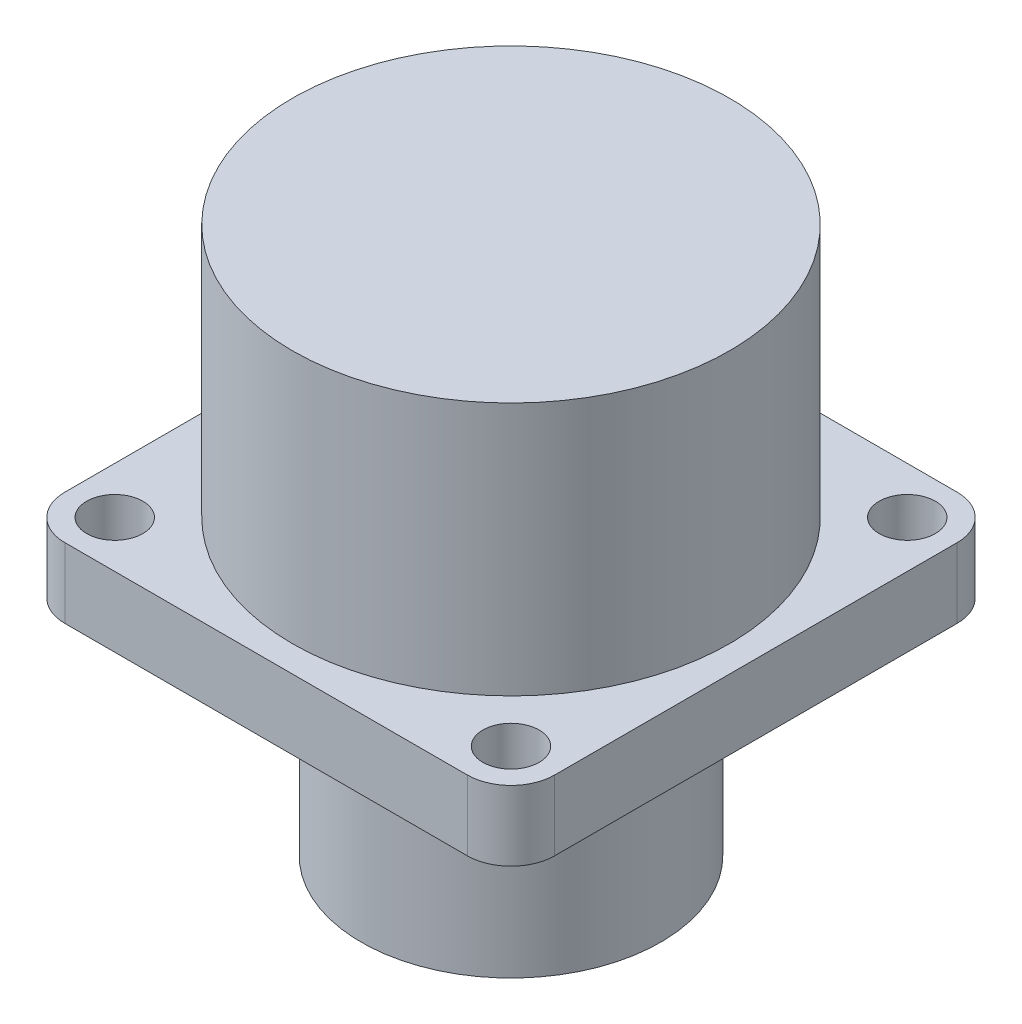
ISO-10303-21;
HEADER;
FILE_DESCRIPTION(('STEP AP214'),'2;1');
FILE_NAME('part.step','',(''),(''),'','','');
FILE_SCHEMA(('AUTOMOTIVE_DESIGN { 1 0 10303 214 1 1 1 1 }'));
ENDSEC;
DATA;
#1=APPLICATION_CONTEXT('core data for automotive mechanical design processes');
#2=APPLICATION_PROTOCOL_DEFINITION('international standard','automotive_design',2000,#1);
#3=PRODUCT_CONTEXT('',#1,'mechanical');
#4=PRODUCT('Part','Part','',(#3));
#5=PRODUCT_RELATED_PRODUCT_CATEGORY('part','',(#4));
#6=PRODUCT_DEFINITION_FORMATION('','',#4);
#7=PRODUCT_DEFINITION_CONTEXT('part definition',#1,'design');
#8=PRODUCT_DEFINITION('design','',#6,#7);
#9=PRODUCT_DEFINITION_SHAPE('','',#8);
#10=(LENGTH_UNIT() NAMED_UNIT(*) SI_UNIT(.MILLI.,.METRE.));
#11=(NAMED_UNIT(*) PLANE_ANGLE_UNIT() SI_UNIT($,.RADIAN.));
#12=(NAMED_UNIT(*) SI_UNIT($,.STERADIAN.) SOLID_ANGLE_UNIT());
#13=UNCERTAINTY_MEASURE_WITH_UNIT(LENGTH_MEASURE(1.E-05),#10,'distance_accuracy_value','');
#14=(GEOMETRIC_REPRESENTATION_CONTEXT(3) GLOBAL_UNCERTAINTY_ASSIGNED_CONTEXT((#13)) GLOBAL_UNIT_ASSIGNED_CONTEXT((#10,
#11,#12)) REPRESENTATION_CONTEXT('',''));
#15=CARTESIAN_POINT('',(0.,0.,0.));
#16=DIRECTION('',(0.,0.,1.));
#17=DIRECTION('',(1.,0.,0.));
#18=AXIS2_PLACEMENT_3D('',#15,#16,#17);
#19=CARTESIAN_POINT('',(14.224,4.064,14.224));
#20=DIRECTION('',(-1.,0.,0.));
#21=DIRECTION('',(0.,0.,1.));
#22=AXIS2_PLACEMENT_3D('',#19,#20,#21);
#23=PLANE('',#22);
#24=DIRECTION('',(0.,0.,-1.));
#25=VECTOR('',#24,1.);
#26=CARTESIAN_POINT('',(14.224,4.064,14.224));
#27=LINE('',#26,#25);
#28=CARTESIAN_POINT('',(14.224,4.064,11.684));
#29=VERTEX_POINT('',#28);
#30=CARTESIAN_POINT('',(14.224,4.064,-11.684));
#31=VERTEX_POINT('',#30);
#32=EDGE_CURVE('E117',#29,#31,#27,.T.);
#33=ORIENTED_EDGE('',*,*,#32,.F.);
#34=DIRECTION('',(0.,-1.,0.));
#35=VECTOR('',#34,1.);
#36=CARTESIAN_POINT('',(14.224,4.064,11.684));
#37=LINE('',#36,#35);
#38=CARTESIAN_POINT('',(14.224,0.,11.684));
#39=VERTEX_POINT('',#38);
#40=EDGE_CURVE('E102',#29,#39,#37,.T.);
#41=ORIENTED_EDGE('',*,*,#40,.T.);
#42=DIRECTION('',(0.,0.,-1.));
#43=VECTOR('',#42,1.);
#44=CARTESIAN_POINT('',(14.224,0.,14.224));
#45=LINE('',#44,#43);
#46=CARTESIAN_POINT('',(14.224,0.,-11.684));
#47=VERTEX_POINT('',#46);
#48=EDGE_CURVE('E114',#39,#47,#45,.T.);
#49=ORIENTED_EDGE('',*,*,#48,.T.);
#50=DIRECTION('',(0.,-1.,0.));
#51=VECTOR('',#50,1.);
#52=CARTESIAN_POINT('',(14.224,4.064,-11.684));
#53=LINE('',#52,#51);
#54=EDGE_CURVE('E119',#47,#31,#53,.F.);
#55=ORIENTED_EDGE('',*,*,#54,.T.);
#56=EDGE_LOOP('',(#33,#41,#49,#55));
#57=FACE_BOUND('',#56,.T.);
#58=ADVANCED_FACE('F33',(#57),#23,.F.);
#59=CARTESIAN_POINT('',(-14.224,4.064,-14.224));
#60=DIRECTION('',(0.,0.,1.));
#61=DIRECTION('',(1.,0.,0.));
#62=AXIS2_PLACEMENT_3D('',#59,#60,#61);
#63=PLANE('',#62);
#64=DIRECTION('',(-1.,0.,0.));
#65=VECTOR('',#64,1.);
#66=CARTESIAN_POINT('',(-14.224,4.064,-14.224));
#67=LINE('',#66,#65);
#68=CARTESIAN_POINT('',(11.684,4.064,-14.224));
#69=VERTEX_POINT('',#68);
#70=CARTESIAN_POINT('',(-11.684,4.064,-14.224));
#71=VERTEX_POINT('',#70);
#72=EDGE_CURVE('E188',#69,#71,#67,.T.);
#73=ORIENTED_EDGE('',*,*,#72,.F.);
#74=DIRECTION('',(0.,-1.,0.));
#75=VECTOR('',#74,1.);
#76=CARTESIAN_POINT('',(11.684,4.064,-14.224));
#77=LINE('',#76,#75);
#78=CARTESIAN_POINT('',(11.684,0.,-14.224));
#79=VERTEX_POINT('',#78);
#80=EDGE_CURVE('E169',#69,#79,#77,.T.);
#81=ORIENTED_EDGE('',*,*,#80,.T.);
#82=DIRECTION('',(-1.,0.,0.));
#83=VECTOR('',#82,1.);
#84=CARTESIAN_POINT('',(-14.224,0.,-14.224));
#85=LINE('',#84,#83);
#86=CARTESIAN_POINT('',(-11.684,0.,-14.224));
#87=VERTEX_POINT('',#86);
#88=EDGE_CURVE('E123',#79,#87,#85,.T.);
#89=ORIENTED_EDGE('',*,*,#88,.T.);
#90=DIRECTION('',(0.,-1.,0.));
#91=VECTOR('',#90,1.);
#92=CARTESIAN_POINT('',(-11.684,4.064,-14.224));
#93=LINE('',#92,#91);
#94=EDGE_CURVE('E167',#87,#71,#93,.F.);
#95=ORIENTED_EDGE('',*,*,#94,.T.);
#96=EDGE_LOOP('',(#73,#81,#89,#95));
#97=FACE_BOUND('',#96,.T.);
#98=ADVANCED_FACE('F239',(#97),#63,.F.);
#99=CARTESIAN_POINT('',(-14.224,4.064,14.224));
#100=DIRECTION('',(1.,0.,0.));
#101=DIRECTION('',(0.,0.,-1.));
#102=AXIS2_PLACEMENT_3D('',#99,#100,#101);
#103=PLANE('',#102);
#104=DIRECTION('',(0.,0.,1.));
#105=VECTOR('',#104,1.);
#106=CARTESIAN_POINT('',(-14.224,0.,14.224));
#107=LINE('',#106,#105);
#108=CARTESIAN_POINT('',(-14.224,0.,-11.684));
#109=VERTEX_POINT('',#108);
#110=CARTESIAN_POINT('',(-14.224,0.,11.684));
#111=VERTEX_POINT('',#110);
#112=EDGE_CURVE('E127',#109,#111,#107,.T.);
#113=ORIENTED_EDGE('',*,*,#112,.T.);
#114=DIRECTION('',(0.,-1.,0.));
#115=VECTOR('',#114,1.);
#116=CARTESIAN_POINT('',(-14.224,4.064,11.684));
#117=LINE('',#116,#115);
#118=CARTESIAN_POINT('',(-14.224,4.064,11.684));
#119=VERTEX_POINT('',#118);
#120=EDGE_CURVE('E11',#111,#119,#117,.F.);
#121=ORIENTED_EDGE('',*,*,#120,.T.);
#122=DIRECTION('',(0.,0.,1.));
#123=VECTOR('',#122,1.);
#124=CARTESIAN_POINT('',(-14.224,4.064,14.224));
#125=LINE('',#124,#123);
#126=CARTESIAN_POINT('',(-14.224,4.064,-11.684));
#127=VERTEX_POINT('',#126);
#128=EDGE_CURVE('E175',#127,#119,#125,.T.);
#129=ORIENTED_EDGE('',*,*,#128,.F.);
#130=DIRECTION('',(0.,-1.,0.));
#131=VECTOR('',#130,1.);
#132=CARTESIAN_POINT('',(-14.224,4.064,-11.684));
#133=LINE('',#132,#131);
#134=EDGE_CURVE('E41',#127,#109,#133,.T.);
#135=ORIENTED_EDGE('',*,*,#134,.T.);
#136=EDGE_LOOP('',(#113,#121,#129,#135));
#137=FACE_BOUND('',#136,.T.);
#138=ADVANCED_FACE('F174',(#137),#103,.F.);
#139=CARTESIAN_POINT('',(-14.224,4.064,14.224));
#140=DIRECTION('',(0.,0.,-1.));
#141=DIRECTION('',(-1.,0.,0.));
#142=AXIS2_PLACEMENT_3D('',#139,#140,#141);
#143=PLANE('',#142);
#144=DIRECTION('',(1.,0.,0.));
#145=VECTOR('',#144,1.);
#146=CARTESIAN_POINT('',(-14.224,0.,14.224));
#147=LINE('',#146,#145);
#148=CARTESIAN_POINT('',(-11.684,0.,14.224));
#149=VERTEX_POINT('',#148);
#150=CARTESIAN_POINT('',(11.684,0.,14.224));
#151=VERTEX_POINT('',#150);
#152=EDGE_CURVE('E137',#149,#151,#147,.T.);
#153=ORIENTED_EDGE('',*,*,#152,.T.);
#154=DIRECTION('',(0.,-1.,0.));
#155=VECTOR('',#154,1.);
#156=CARTESIAN_POINT('',(11.684,4.064,14.224));
#157=LINE('',#156,#155);
#158=CARTESIAN_POINT('',(11.684,4.064,14.224));
#159=VERTEX_POINT('',#158);
#160=EDGE_CURVE('E103',#151,#159,#157,.F.);
#161=ORIENTED_EDGE('',*,*,#160,.T.);
#162=DIRECTION('',(1.,0.,0.));
#163=VECTOR('',#162,1.);
#164=CARTESIAN_POINT('',(-14.224,4.064,14.224));
#165=LINE('',#164,#163);
#166=CARTESIAN_POINT('',(-11.684,4.064,14.224));
#167=VERTEX_POINT('',#166);
#168=EDGE_CURVE('E133',#167,#159,#165,.T.);
#169=ORIENTED_EDGE('',*,*,#168,.F.);
#170=DIRECTION('',(0.,-1.,0.));
#171=VECTOR('',#170,1.);
#172=CARTESIAN_POINT('',(-11.684,4.064,14.224));
#173=LINE('',#172,#171);
#174=EDGE_CURVE('E108',#167,#149,#173,.T.);
#175=ORIENTED_EDGE('',*,*,#174,.T.);
#176=EDGE_LOOP('',(#153,#161,#169,#175));
#177=FACE_BOUND('',#176,.T.);
#178=ADVANCED_FACE('F183',(#177),#143,.F.);
#179=CARTESIAN_POINT('',(0.,4.064,0.));
#180=DIRECTION('',(0.,-1.,0.));
#181=DIRECTION('',(0.,0.,-1.));
#182=AXIS2_PLACEMENT_3D('',#179,#180,#181);
#183=PLANE('',#182);
#184=CARTESIAN_POINT('',(-11.5062,4.064,11.5062));
#185=DIRECTION('',(0.,1.,0.));
#186=DIRECTION('',(0.,0.,1.));
#187=AXIS2_PLACEMENT_3D('',#184,#185,#186);
#188=CIRCLE('',#187,1.63195);
#189=CARTESIAN_POINT('',(-11.5062,4.064,13.13815));
#190=VERTEX_POINT('',#189);
#191=EDGE_CURVE('E205',#190,#190,#188,.T.);
#192=ORIENTED_EDGE('',*,*,#191,.F.);
#193=EDGE_LOOP('',(#192));
#194=FACE_BOUND('',#193,.T.);
#195=CARTESIAN_POINT('',(11.5062,4.064,-11.5062));
#196=DIRECTION('',(0.,1.,0.));
#197=DIRECTION('',(0.,0.,1.));
#198=AXIS2_PLACEMENT_3D('',#195,#196,#197);
#199=CIRCLE('',#198,1.63195);
#200=CARTESIAN_POINT('',(11.5062,4.064,-9.87425));
#201=VERTEX_POINT('',#200);
#202=EDGE_CURVE('E150',#201,#201,#199,.T.);
#203=ORIENTED_EDGE('',*,*,#202,.F.);
#204=EDGE_LOOP('',(#203));
#205=FACE_BOUND('',#204,.T.);
#206=CARTESIAN_POINT('',(-11.5062,4.064,-11.5062));
#207=DIRECTION('',(0.,1.,0.));
#208=DIRECTION('',(0.,0.,1.));
#209=AXIS2_PLACEMENT_3D('',#206,#207,#208);
#210=CIRCLE('',#209,1.63195);
#211=CARTESIAN_POINT('',(-11.5062,4.064,-9.87425));
#212=VERTEX_POINT('',#211);
#213=EDGE_CURVE('E146',#212,#212,#210,.T.);
#214=ORIENTED_EDGE('',*,*,#213,.F.);
#215=EDGE_LOOP('',(#214));
#216=FACE_BOUND('',#215,.T.);
#217=CARTESIAN_POINT('',(11.5062,4.064,11.5062));
#218=DIRECTION('',(0.,1.,0.));
#219=DIRECTION('',(0.,0.,1.));
#220=AXIS2_PLACEMENT_3D('',#217,#218,#219);
#221=CIRCLE('',#220,1.63195);
#222=CARTESIAN_POINT('',(11.5062,4.064,13.13815));
#223=VERTEX_POINT('',#222);
#224=EDGE_CURVE('E142',#223,#223,#221,.T.);
#225=ORIENTED_EDGE('',*,*,#224,.F.);
#226=EDGE_LOOP('',(#225));
#227=FACE_BOUND('',#226,.T.);
#228=CARTESIAN_POINT('',(0.,4.064,0.));
#229=DIRECTION('',(0.,1.,0.));
#230=DIRECTION('',(0.,0.,1.));
#231=AXIS2_PLACEMENT_3D('',#228,#229,#230);
#232=CIRCLE('',#231,12.7);
#233=CARTESIAN_POINT('',(0.,4.064,12.7));
#234=VERTEX_POINT('',#233);
#235=EDGE_CURVE('E185',#234,#234,#232,.T.);
#236=ORIENTED_EDGE('',*,*,#235,.F.);
#237=EDGE_LOOP('',(#236));
#238=FACE_BOUND('',#237,.T.);
#239=ORIENTED_EDGE('',*,*,#168,.T.);
#240=CARTESIAN_POINT('',(11.684,4.064,11.684));
#241=DIRECTION('',(0.,-1.,0.));
#242=DIRECTION('',(0.,0.,-1.));
#243=AXIS2_PLACEMENT_3D('',#240,#241,#242);
#244=CIRCLE('',#243,2.54);
#245=EDGE_CURVE('E165',#159,#29,#244,.F.);
#246=ORIENTED_EDGE('',*,*,#245,.T.);
#247=ORIENTED_EDGE('',*,*,#32,.T.);
#248=CARTESIAN_POINT('',(11.684,4.064,-11.684));
#249=DIRECTION('',(0.,-1.,0.));
#250=DIRECTION('',(0.,0.,-1.));
#251=AXIS2_PLACEMENT_3D('',#248,#249,#250);
#252=CIRCLE('',#251,2.54);
#253=EDGE_CURVE('E163',#31,#69,#252,.F.);
#254=ORIENTED_EDGE('',*,*,#253,.T.);
#255=ORIENTED_EDGE('',*,*,#72,.T.);
#256=CARTESIAN_POINT('',(-11.684,4.064,-11.684));
#257=DIRECTION('',(0.,-1.,0.));
#258=DIRECTION('',(0.,0.,-1.));
#259=AXIS2_PLACEMENT_3D('',#256,#257,#258);
#260=CIRCLE('',#259,2.54);
#261=EDGE_CURVE('E53',#71,#127,#260,.F.);
#262=ORIENTED_EDGE('',*,*,#261,.T.);
#263=ORIENTED_EDGE('',*,*,#128,.T.);
#264=CARTESIAN_POINT('',(-11.684,4.064,11.684));
#265=DIRECTION('',(0.,-1.,0.));
#266=DIRECTION('',(0.,0.,-1.));
#267=AXIS2_PLACEMENT_3D('',#264,#265,#266);
#268=CIRCLE('',#267,2.54);
#269=EDGE_CURVE('E161',#119,#167,#268,.F.);
#270=ORIENTED_EDGE('',*,*,#269,.T.);
#271=EDGE_LOOP('',(#239,#246,#247,#254,#255,#262,#263,#270));
#272=FACE_BOUND('',#271,.T.);
#273=ADVANCED_FACE('F211',(#194,#205,#216,#227,#238,#272),#183,.F.);
#274=CARTESIAN_POINT('',(0.,0.,0.));
#275=DIRECTION('',(0.,-1.,0.));
#276=DIRECTION('',(0.,0.,-1.));
#277=AXIS2_PLACEMENT_3D('',#274,#275,#276);
#278=PLANE('',#277);
#279=CARTESIAN_POINT('',(-11.5062,0.,11.5062));
#280=DIRECTION('',(0.,-1.,0.));
#281=DIRECTION('',(0.,0.,-1.));
#282=AXIS2_PLACEMENT_3D('',#279,#280,#281);
#283=CIRCLE('',#282,1.63195);
#284=CARTESIAN_POINT('',(-11.5062,0.,9.87425));
#285=VERTEX_POINT('',#284);
#286=EDGE_CURVE('E202',#285,#285,#283,.T.);
#287=ORIENTED_EDGE('',*,*,#286,.F.);
#288=EDGE_LOOP('',(#287));
#289=FACE_BOUND('',#288,.T.);
#290=CARTESIAN_POINT('',(11.5062,0.,-11.5062));
#291=DIRECTION('',(0.,-1.,0.));
#292=DIRECTION('',(0.,0.,-1.));
#293=AXIS2_PLACEMENT_3D('',#290,#291,#292);
#294=CIRCLE('',#293,1.63195);
#295=CARTESIAN_POINT('',(11.5062,0.,-13.13815));
#296=VERTEX_POINT('',#295);
#297=EDGE_CURVE('E147',#296,#296,#294,.T.);
#298=ORIENTED_EDGE('',*,*,#297,.F.);
#299=EDGE_LOOP('',(#298));
#300=FACE_BOUND('',#299,.T.);
#301=CARTESIAN_POINT('',(-11.5062,0.,-11.5062));
#302=DIRECTION('',(0.,-1.,0.));
#303=DIRECTION('',(0.,0.,-1.));
#304=AXIS2_PLACEMENT_3D('',#301,#302,#303);
#305=CIRCLE('',#304,1.63195);
#306=CARTESIAN_POINT('',(-11.5062,0.,-13.13815));
#307=VERTEX_POINT('',#306);
#308=EDGE_CURVE('E143',#307,#307,#305,.T.);
#309=ORIENTED_EDGE('',*,*,#308,.F.);
#310=EDGE_LOOP('',(#309));
#311=FACE_BOUND('',#310,.T.);
#312=CARTESIAN_POINT('',(11.5062,0.,11.5062));
#313=DIRECTION('',(0.,-1.,0.));
#314=DIRECTION('',(0.,0.,-1.));
#315=AXIS2_PLACEMENT_3D('',#312,#313,#314);
#316=CIRCLE('',#315,1.63195);
#317=CARTESIAN_POINT('',(11.5062,0.,9.87425));
#318=VERTEX_POINT('',#317);
#319=EDGE_CURVE('E139',#318,#318,#316,.T.);
#320=ORIENTED_EDGE('',*,*,#319,.F.);
#321=EDGE_LOOP('',(#320));
#322=FACE_BOUND('',#321,.T.);
#323=CARTESIAN_POINT('',(0.,0.,0.));
#324=DIRECTION('',(0.,-1.,0.));
#325=DIRECTION('',(0.,0.,-1.));
#326=AXIS2_PLACEMENT_3D('',#323,#324,#325);
#327=CIRCLE('',#326,8.6995);
#328=CARTESIAN_POINT('',(0.,0.,-8.6995));
#329=VERTEX_POINT('',#328);
#330=EDGE_CURVE('E151',#329,#329,#327,.T.);
#331=ORIENTED_EDGE('',*,*,#330,.F.);
#332=EDGE_LOOP('',(#331));
#333=FACE_BOUND('',#332,.T.);
#334=ORIENTED_EDGE('',*,*,#48,.F.);
#335=CARTESIAN_POINT('',(11.684,0.,11.684));
#336=DIRECTION('',(0.,-1.,0.));
#337=DIRECTION('',(0.,0.,-1.));
#338=AXIS2_PLACEMENT_3D('',#335,#336,#337);
#339=CIRCLE('',#338,2.54);
#340=EDGE_CURVE('E98',#39,#151,#339,.T.);
#341=ORIENTED_EDGE('',*,*,#340,.T.);
#342=ORIENTED_EDGE('',*,*,#152,.F.);
#343=CARTESIAN_POINT('',(-11.684,0.,11.684));
#344=DIRECTION('',(0.,-1.,0.));
#345=DIRECTION('',(0.,0.,-1.));
#346=AXIS2_PLACEMENT_3D('',#343,#344,#345);
#347=CIRCLE('',#346,2.54);
#348=EDGE_CURVE('E154',#149,#111,#347,.T.);
#349=ORIENTED_EDGE('',*,*,#348,.T.);
#350=ORIENTED_EDGE('',*,*,#112,.F.);
#351=CARTESIAN_POINT('',(-11.684,0.,-11.684));
#352=DIRECTION('',(0.,-1.,0.));
#353=DIRECTION('',(0.,0.,-1.));
#354=AXIS2_PLACEMENT_3D('',#351,#352,#353);
#355=CIRCLE('',#354,2.54);
#356=EDGE_CURVE('E118',#109,#87,#355,.T.);
#357=ORIENTED_EDGE('',*,*,#356,.T.);
#358=ORIENTED_EDGE('',*,*,#88,.F.);
#359=CARTESIAN_POINT('',(11.684,0.,-11.684));
#360=DIRECTION('',(0.,-1.,0.));
#361=DIRECTION('',(0.,0.,-1.));
#362=AXIS2_PLACEMENT_3D('',#359,#360,#361);
#363=CIRCLE('',#362,2.54);
#364=EDGE_CURVE('E109',#79,#47,#363,.T.);
#365=ORIENTED_EDGE('',*,*,#364,.T.);
#366=EDGE_LOOP('',(#334,#341,#342,#349,#350,#357,#358,#365));
#367=FACE_BOUND('',#366,.T.);
#368=ADVANCED_FACE('F121',(#289,#300,#311,#322,#333,#367),#278,.T.);
#369=CARTESIAN_POINT('',(0.,18.796,0.));
#370=DIRECTION('',(0.,-1.,0.));
#371=DIRECTION('',(0.,0.,-1.));
#372=AXIS2_PLACEMENT_3D('',#369,#370,#371);
#373=CYLINDRICAL_SURFACE('',#372,12.7);
#374=CARTESIAN_POINT('',(0.,18.796,0.));
#375=DIRECTION('',(0.,1.,0.));
#376=DIRECTION('',(0.,0.,1.));
#377=AXIS2_PLACEMENT_3D('',#374,#375,#376);
#378=CIRCLE('',#377,12.7);
#379=CARTESIAN_POINT('',(0.,18.796,12.7));
#380=VERTEX_POINT('',#379);
#381=EDGE_CURVE('E124',#380,#380,#378,.T.);
#382=ORIENTED_EDGE('',*,*,#381,.F.);
#383=EDGE_LOOP('',(#382));
#384=FACE_BOUND('',#383,.T.);
#385=ORIENTED_EDGE('',*,*,#235,.T.);
#386=EDGE_LOOP('',(#385));
#387=FACE_BOUND('',#386,.T.);
#388=ADVANCED_FACE('F223',(#384,#387),#373,.T.);
#389=CARTESIAN_POINT('',(0.,18.796,0.));
#390=DIRECTION('',(0.,1.,0.));
#391=DIRECTION('',(0.,0.,1.));
#392=AXIS2_PLACEMENT_3D('',#389,#390,#391);
#393=PLANE('',#392);
#394=ORIENTED_EDGE('',*,*,#381,.T.);
#395=EDGE_LOOP('',(#394));
#396=FACE_BOUND('',#395,.T.);
#397=ADVANCED_FACE('F225',(#396),#393,.T.);
#398=CARTESIAN_POINT('',(0.,-12.954,0.));
#399=DIRECTION('',(0.,1.,0.));
#400=DIRECTION('',(0.,0.,1.));
#401=AXIS2_PLACEMENT_3D('',#398,#399,#400);
#402=CYLINDRICAL_SURFACE('',#401,8.6995);
#403=CARTESIAN_POINT('',(0.,-12.954,0.));
#404=DIRECTION('',(0.,-1.,0.));
#405=DIRECTION('',(0.,0.,-1.));
#406=AXIS2_PLACEMENT_3D('',#403,#404,#405);
#407=CIRCLE('',#406,8.6995);
#408=CARTESIAN_POINT('',(0.,-12.954,-8.6995));
#409=VERTEX_POINT('',#408);
#410=EDGE_CURVE('E130',#409,#409,#407,.T.);
#411=ORIENTED_EDGE('',*,*,#410,.F.);
#412=EDGE_LOOP('',(#411));
#413=FACE_BOUND('',#412,.T.);
#414=ORIENTED_EDGE('',*,*,#330,.T.);
#415=EDGE_LOOP('',(#414));
#416=FACE_BOUND('',#415,.T.);
#417=ADVANCED_FACE('F232',(#413,#416),#402,.T.);
#418=CARTESIAN_POINT('',(0.,-12.954,0.));
#419=DIRECTION('',(0.,-1.,0.));
#420=DIRECTION('',(0.,0.,-1.));
#421=AXIS2_PLACEMENT_3D('',#418,#419,#420);
#422=PLANE('',#421);
#423=ORIENTED_EDGE('',*,*,#410,.T.);
#424=EDGE_LOOP('',(#423));
#425=FACE_BOUND('',#424,.T.);
#426=ADVANCED_FACE('F356',(#425),#422,.T.);
#427=CARTESIAN_POINT('',(11.5062,4.064,11.5062));
#428=DIRECTION('',(0.,1.,0.));
#429=DIRECTION('',(0.,0.,1.));
#430=AXIS2_PLACEMENT_3D('',#427,#428,#429);
#431=CYLINDRICAL_SURFACE('',#430,1.63195);
#432=ORIENTED_EDGE('',*,*,#319,.T.);
#433=EDGE_LOOP('',(#432));
#434=FACE_BOUND('',#433,.T.);
#435=ORIENTED_EDGE('',*,*,#224,.T.);
#436=EDGE_LOOP('',(#435));
#437=FACE_BOUND('',#436,.T.);
#438=ADVANCED_FACE('F346',(#434,#437),#431,.F.);
#439=CARTESIAN_POINT('',(-11.5062,4.064,-11.5062));
#440=DIRECTION('',(0.,1.,0.));
#441=DIRECTION('',(0.,0.,1.));
#442=AXIS2_PLACEMENT_3D('',#439,#440,#441);
#443=CYLINDRICAL_SURFACE('',#442,1.63195);
#444=ORIENTED_EDGE('',*,*,#308,.T.);
#445=EDGE_LOOP('',(#444));
#446=FACE_BOUND('',#445,.T.);
#447=ORIENTED_EDGE('',*,*,#213,.T.);
#448=EDGE_LOOP('',(#447));
#449=FACE_BOUND('',#448,.T.);
#450=ADVANCED_FACE('F336',(#446,#449),#443,.F.);
#451=CARTESIAN_POINT('',(11.5062,4.064,-11.5062));
#452=DIRECTION('',(0.,1.,0.));
#453=DIRECTION('',(0.,0.,1.));
#454=AXIS2_PLACEMENT_3D('',#451,#452,#453);
#455=CYLINDRICAL_SURFACE('',#454,1.63195);
#456=ORIENTED_EDGE('',*,*,#297,.T.);
#457=EDGE_LOOP('',(#456));
#458=FACE_BOUND('',#457,.T.);
#459=ORIENTED_EDGE('',*,*,#202,.T.);
#460=EDGE_LOOP('',(#459));
#461=FACE_BOUND('',#460,.T.);
#462=ADVANCED_FACE('F326',(#458,#461),#455,.F.);
#463=CARTESIAN_POINT('',(-11.5062,4.064,11.5062));
#464=DIRECTION('',(0.,1.,0.));
#465=DIRECTION('',(0.,0.,1.));
#466=AXIS2_PLACEMENT_3D('',#463,#464,#465);
#467=CYLINDRICAL_SURFACE('',#466,1.63195);
#468=ORIENTED_EDGE('',*,*,#286,.T.);
#469=EDGE_LOOP('',(#468));
#470=FACE_BOUND('',#469,.T.);
#471=ORIENTED_EDGE('',*,*,#191,.T.);
#472=EDGE_LOOP('',(#471));
#473=FACE_BOUND('',#472,.T.);
#474=ADVANCED_FACE('F209',(#470,#473),#467,.F.);
#475=CARTESIAN_POINT('',(11.684,4.064,11.684));
#476=DIRECTION('',(0.,-1.,0.));
#477=DIRECTION('',(0.,0.,-1.));
#478=AXIS2_PLACEMENT_3D('',#475,#476,#477);
#479=CYLINDRICAL_SURFACE('',#478,2.54);
#480=ORIENTED_EDGE('',*,*,#245,.F.);
#481=ORIENTED_EDGE('',*,*,#160,.F.);
#482=ORIENTED_EDGE('',*,*,#340,.F.);
#483=ORIENTED_EDGE('',*,*,#40,.F.);
#484=EDGE_LOOP('',(#480,#481,#482,#483));
#485=FACE_BOUND('',#484,.T.);
#486=ADVANCED_FACE('F101',(#485),#479,.T.);
#487=CARTESIAN_POINT('',(11.684,4.064,-11.684));
#488=DIRECTION('',(0.,-1.,0.));
#489=DIRECTION('',(0.,0.,-1.));
#490=AXIS2_PLACEMENT_3D('',#487,#488,#489);
#491=CYLINDRICAL_SURFACE('',#490,2.54);
#492=ORIENTED_EDGE('',*,*,#253,.F.);
#493=ORIENTED_EDGE('',*,*,#54,.F.);
#494=ORIENTED_EDGE('',*,*,#364,.F.);
#495=ORIENTED_EDGE('',*,*,#80,.F.);
#496=EDGE_LOOP('',(#492,#493,#494,#495));
#497=FACE_BOUND('',#496,.T.);
#498=ADVANCED_FACE('F250',(#497),#491,.T.);
#499=CARTESIAN_POINT('',(-11.684,4.064,11.684));
#500=DIRECTION('',(0.,-1.,0.));
#501=DIRECTION('',(0.,0.,-1.));
#502=AXIS2_PLACEMENT_3D('',#499,#500,#501);
#503=CYLINDRICAL_SURFACE('',#502,2.54);
#504=ORIENTED_EDGE('',*,*,#269,.F.);
#505=ORIENTED_EDGE('',*,*,#120,.F.);
#506=ORIENTED_EDGE('',*,*,#348,.F.);
#507=ORIENTED_EDGE('',*,*,#174,.F.);
#508=EDGE_LOOP('',(#504,#505,#506,#507));
#509=FACE_BOUND('',#508,.T.);
#510=ADVANCED_FACE('F180',(#509),#503,.T.);
#511=CARTESIAN_POINT('',(-11.684,4.064,-11.684));
#512=DIRECTION('',(0.,-1.,0.));
#513=DIRECTION('',(0.,0.,-1.));
#514=AXIS2_PLACEMENT_3D('',#511,#512,#513);
#515=CYLINDRICAL_SURFACE('',#514,2.54);
#516=ORIENTED_EDGE('',*,*,#261,.F.);
#517=ORIENTED_EDGE('',*,*,#94,.F.);
#518=ORIENTED_EDGE('',*,*,#356,.F.);
#519=ORIENTED_EDGE('',*,*,#134,.F.);
#520=EDGE_LOOP('',(#516,#517,#518,#519));
#521=FACE_BOUND('',#520,.T.);
#522=ADVANCED_FACE('F35',(#521),#515,.T.);
#523=CLOSED_SHELL('',(#58,#98,#138,#178,#273,#368,#388,#397,#417,#426,#438,#450,#462,#474,#486,
#498,#510,#522));
#524=MANIFOLD_SOLID_BREP('B2',#523);
#525=ADVANCED_BREP_SHAPE_REPRESENTATION('',(#18,#524),#14);
#526=SHAPE_DEFINITION_REPRESENTATION(#9,#525);
ENDSEC;
END-ISO-10303-21;
